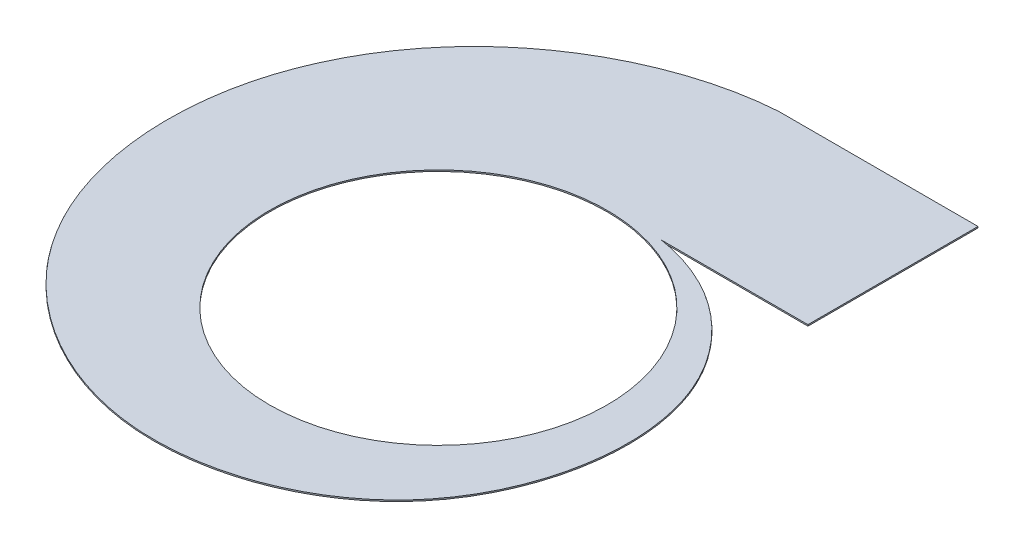
ISO-10303-21;
HEADER;
FILE_DESCRIPTION(('STEP AP214'),'2;1');
FILE_NAME('part.step','',(''),(''),'','','');
FILE_SCHEMA(('AUTOMOTIVE_DESIGN { 1 0 10303 214 1 1 1 1 }'));
ENDSEC;
DATA;
#1=APPLICATION_CONTEXT('core data for automotive mechanical design processes');
#2=APPLICATION_PROTOCOL_DEFINITION('international standard','automotive_design',2000,#1);
#3=PRODUCT_CONTEXT('',#1,'mechanical');
#4=PRODUCT('Part','Part','',(#3));
#5=PRODUCT_RELATED_PRODUCT_CATEGORY('part','',(#4));
#6=PRODUCT_DEFINITION_FORMATION('','',#4);
#7=PRODUCT_DEFINITION_CONTEXT('part definition',#1,'design');
#8=PRODUCT_DEFINITION('design','',#6,#7);
#9=PRODUCT_DEFINITION_SHAPE('','',#8);
#10=(LENGTH_UNIT() NAMED_UNIT(*) SI_UNIT(.MILLI.,.METRE.));
#11=(NAMED_UNIT(*) PLANE_ANGLE_UNIT() SI_UNIT($,.RADIAN.));
#12=(NAMED_UNIT(*) SI_UNIT($,.STERADIAN.) SOLID_ANGLE_UNIT());
#13=UNCERTAINTY_MEASURE_WITH_UNIT(LENGTH_MEASURE(1.E-05),#10,'distance_accuracy_value','');
#14=(GEOMETRIC_REPRESENTATION_CONTEXT(3) GLOBAL_UNCERTAINTY_ASSIGNED_CONTEXT((#13)) GLOBAL_UNIT_ASSIGNED_CONTEXT((#10,
#11,#12)) REPRESENTATION_CONTEXT('',''));
#15=CARTESIAN_POINT('',(0.,0.,0.));
#16=DIRECTION('',(0.,0.,1.));
#17=DIRECTION('',(1.,0.,0.));
#18=AXIS2_PLACEMENT_3D('',#15,#16,#17);
#19=CARTESIAN_POINT('',(-202.088029277198,0.,340.089037520894));
#20=DIRECTION('',(0.,-1.,0.));
#21=DIRECTION('',(0.,0.,-1.));
#22=AXIS2_PLACEMENT_3D('',#19,#20,#21);
#23=PLANE('',#22);
#24=CARTESIAN_POINT('',(0.,0.,0.));
#25=DIRECTION('',(0.,1.,0.));
#26=DIRECTION('',(0.,0.,1.));
#27=AXIS2_PLACEMENT_3D('',#24,#25,#26);
#28=CIRCLE('',#27,248.);
#29=CARTESIAN_POINT('',(0.,0.,248.));
#30=VERTEX_POINT('',#29);
#31=EDGE_CURVE('E126',#30,#30,#28,.T.);
#32=ORIENTED_EDGE('',*,*,#31,.F.);
#33=EDGE_LOOP('',(#32));
#34=FACE_BOUND('',#33,.T.);
#35=CARTESIAN_POINT('',(-1.51614831800373E-12,0.,-500.));
#36=CARTESIAN_POINT('',(-121.735694782618,0.,-491.432273979318));
#37=CARTESIAN_POINT('',(-313.70035987812,0.,-396.44166070075));
#38=CARTESIAN_POINT('',(-452.526897534728,0.,-136.273127559046));
#39=CARTESIAN_POINT('',(-438.495522047138,0.,84.5434590160957));
#40=CARTESIAN_POINT('',(-316.990167099942,0.,288.560325686227));
#41=CARTESIAN_POINT('',(-69.9789110870108,0.,425.752164190326));
#42=CARTESIAN_POINT('',(285.053092388066,0.,296.782675328895));
#43=CARTESIAN_POINT('',(348.131054402756,0.,-49.5077087625764));
#44=CARTESIAN_POINT('',(180.649502040765,0.,-235.122306433307));
#45=CARTESIAN_POINT('',(56.0182707534848,0.,-259.081421156658));
#46=CARTESIAN_POINT('',(0.,0.,-250.));
#47=B_SPLINE_CURVE_WITH_KNOTS('',3,(#35,#36,#37,#38,#39,#40,#41,#42,#43,#44,#45,#46),
.UNSPECIFIED.,.F.,.F.,(4,1,1,1,1,1,1,1,1,4),(0.,0.158819890851184,0.25244839977915,
0.369226367804826,0.42541946423916,0.556944650266808,0.698898778526058,0.846399015982612,
0.926374081741202,1.),.UNSPECIFIED.);
#48=CARTESIAN_POINT('',(-59.0712145917898,0.,376.585920873766));
#49=VERTEX_POINT('',#48);
#50=CARTESIAN_POINT('',(77.7700123232968,0.,-250.000000000145));
#51=VERTEX_POINT('',#50);
#52=EDGE_CURVE('E59',#49,#51,#47,.T.);
#53=ORIENTED_EDGE('',*,*,#52,.T.);
#54=DIRECTION('',(1.,0.,0.));
#55=VECTOR('',#54,1.);
#56=CARTESIAN_POINT('',(0.,0.,-250.));
#57=LINE('',#56,#55);
#58=CARTESIAN_POINT('',(293.259068653268,0.,-250.));
#59=VERTEX_POINT('',#58);
#60=EDGE_CURVE('E185',#51,#59,#57,.T.);
#61=ORIENTED_EDGE('',*,*,#60,.T.);
#62=DIRECTION('',(0.,0.,1.));
#63=VECTOR('',#62,1.);
#64=CARTESIAN_POINT('',(293.259068653268,0.,-500.));
#65=LINE('',#64,#63);
#66=CARTESIAN_POINT('',(293.259068653268,0.,-500.));
#67=VERTEX_POINT('',#66);
#68=EDGE_CURVE('E118',#67,#59,#65,.T.);
#69=ORIENTED_EDGE('',*,*,#68,.F.);
#70=DIRECTION('',(1.,0.,0.));
#71=VECTOR('',#70,1.);
#72=CARTESIAN_POINT('',(-1.51614831800373E-12,0.,-500.));
#73=LINE('',#72,#71);
#74=CARTESIAN_POINT('',(-1.51614831800373E-12,0.,-500.));
#75=VERTEX_POINT('',#74);
#76=EDGE_CURVE('E105',#75,#67,#73,.T.);
#77=ORIENTED_EDGE('',*,*,#76,.F.);
#78=CARTESIAN_POINT('',(-71.8416246862978,0.,375.710516909708));
#79=VERTEX_POINT('',#78);
#80=EDGE_CURVE('E13',#75,#79,#47,.T.);
#81=ORIENTED_EDGE('',*,*,#80,.T.);
#82=CARTESIAN_POINT('',(0.,0.,-250.));
#83=CARTESIAN_POINT('',(8.18123086876726,0.,-251.302083333026));
#84=CARTESIAN_POINT('',(16.4904858589972,0.,-252.202239115932));
#85=CARTESIAN_POINT('',(33.2838432146078,0.,-253.165004897292));
#86=CARTESIAN_POINT('',(41.767918014095,0.,-253.227597369565));
#87=CARTESIAN_POINT('',(58.8255292754711,0.,-252.489812838351));
#88=CARTESIAN_POINT('',(67.3990361988134,0.,-251.68942117223));
#89=CARTESIAN_POINT('',(84.5468495515692,0.,-249.209035812598));
#90=CARTESIAN_POINT('',(93.1211247685697,0.,-247.529030536377));
#91=CARTESIAN_POINT('',(110.179448675384,0.,-243.281971110244));
#92=CARTESIAN_POINT('',(118.66346480226,0.,-240.714908643898));
#93=CARTESIAN_POINT('',(135.448838643004,0.,-234.695772918887));
#94=CARTESIAN_POINT('',(143.750162787134,0.,-231.243694761559));
#95=CARTESIAN_POINT('',(160.077308395461,0.,-223.466249466396));
#96=CARTESIAN_POINT('',(168.103095643203,0.,-219.14088096369));
#97=CARTESIAN_POINT('',(183.786929166319,0.,-209.638354885954));
#98=CARTESIAN_POINT('',(191.444940950985,0.,-204.461199557863));
#99=CARTESIAN_POINT('',(206.302623466448,0.,-193.28636485957));
#100=CARTESIAN_POINT('',(213.50225981272,0.,-187.288691385962));
#101=CARTESIAN_POINT('',(227.355264370716,0.,-174.513728488617));
#102=CARTESIAN_POINT('',(234.008598689343,0.,-167.736448608729));
#103=CARTESIAN_POINT('',(246.684770923066,0.,-153.452592355728));
#104=CARTESIAN_POINT('',(252.707575824426,0.,-145.946029131675));
#105=CARTESIAN_POINT('',(264.043165004688,0.,-130.262996352308));
#106=CARTESIAN_POINT('',(269.355917530424,0.,-122.086543467484));
#107=CARTESIAN_POINT('',(279.197554898152,0.,-105.131744499288));
#108=CARTESIAN_POINT('',(283.726409621811,0.,-96.3534184851331));
#109=CARTESIAN_POINT('',(291.933011092096,0.,-78.2709576757544));
#110=CARTESIAN_POINT('',(295.610729718482,0.,-68.9668461837094));
#111=CARTESIAN_POINT('',(302.055300527236,0.,-49.9163187948688));
#112=CARTESIAN_POINT('',(304.822126933795,0.,-40.1699292330862));
#113=CARTESIAN_POINT('',(309.393446559202,0.,-20.3250245640646));
#114=CARTESIAN_POINT('',(311.19791666681,0.,-10.2265385853717));
#115=CARTESIAN_POINT('',(313.80208333319,0.,10.2265385853717));
#116=CARTESIAN_POINT('',(314.601759745985,0.,20.5810981281708));
#117=CARTESIAN_POINT('',(315.163575101264,0.,41.4453734866293));
#118=CARTESIAN_POINT('',(314.925697135991,0.,51.955055437251));
#119=CARTESIAN_POINT('',(313.389873122328,0.,73.0246821043311));
#120=CARTESIAN_POINT('',(312.091913646437,0.,83.5845910737915));
#121=CARTESIAN_POINT('',(308.424085304918,0.,104.646879333399));
#122=CARTESIAN_POINT('',(306.054206695925,0.,115.149221353839));
#123=CARTESIAN_POINT('',(300.241736514608,0.,135.986781135752));
#124=CARTESIAN_POINT('',(296.799139049597,0.,146.321960485977));
#125=CARTESIAN_POINT('',(288.851700556733,0.,166.714935062538));
#126=CARTESIAN_POINT('',(284.346857615167,0.,176.772691136304));
#127=CARTESIAN_POINT('',(274.296788150606,0.,196.501059173741));
#128=CARTESIAN_POINT('',(268.751563778678,0.,206.171631657383));
#129=CARTESIAN_POINT('',(256.653978741307,0.,225.017553672595));
#130=CARTESIAN_POINT('',(250.101624338251,0.,234.192863818506));
#131=CARTESIAN_POINT('',(236.034287727501,0.,251.943048247245));
#132=CARTESIAN_POINT('',(228.519315892065,0.,260.517883668511));
#133=CARTESIAN_POINT('',(212.58226450297,0.,276.965947185267));
#134=CARTESIAN_POINT('',(204.160199387239,0.,284.839137373345));
#135=CARTESIAN_POINT('',(186.475120704669,0.,299.787933776882));
#136=CARTESIAN_POINT('',(177.212125551479,0.,306.863503462129));
#137=CARTESIAN_POINT('',(157.921492035754,0.,320.12739541053));
#138=CARTESIAN_POINT('',(147.893875927803,0.,326.315682934834));
#139=CARTESIAN_POINT('',(127.159841084605,0.,337.722731057653));
#140=CARTESIAN_POINT('',(116.453448267127,0.,342.941459114445));
#141=CARTESIAN_POINT('',(94.4565125505682,0.,352.335503565987));
#142=CARTESIAN_POINT('',(83.1659990126438,0.,356.510790002129));
#143=CARTESIAN_POINT('',(60.1034562179506,0.,363.753400293993));
#144=CARTESIAN_POINT('',(48.3314595051577,0.,366.820697137299));
#145=CARTESIAN_POINT('',(24.4156368331883,0.,371.792967189722));
#146=CARTESIAN_POINT('',(12.271846302555,0.,373.697916666581));
#147=CARTESIAN_POINT('',(-12.2718463025549,0.,376.302083333419));
#148=CARTESIAN_POINT('',(-24.6717103972528,0.,377.001280376191));
#149=CARTESIAN_POINT('',(-49.6069037587423,0.,377.162145305084));
#150=CARTESIAN_POINT('',(-62.1421928603835,0.,376.623796902581));
#151=CARTESIAN_POINT('',(-87.2238349332148,0.,374.289933406142));
#152=CARTESIAN_POINT('',(-99.7701459485291,0.,372.49440611977));
#153=CARTESIAN_POINT('',(-124.746909115469,0.,367.63913479811));
#154=CARTESIAN_POINT('',(-137.177317939081,0.,364.579382854976));
#155=CARTESIAN_POINT('',(-161.794113596146,0.,357.201501919467));
#156=CARTESIAN_POINT('',(-173.980456169745,0.,352.883369455503));
#157=CARTESIAN_POINT('',(-197.981031482019,0.,343.007628194371));
#158=CARTESIAN_POINT('',(-209.795219485259,0.,337.450020469828));
#159=CARTESIAN_POINT('',(-232.924809952237,0.,325.127326833763));
#160=CARTESIAN_POINT('',(-244.240167672522,0.,318.362246594301));
#161=CARTESIAN_POINT('',(-266.248178177912,0.,303.669602596026));
#162=CARTESIAN_POINT('',(-276.940786686513,0.,295.742049119143));
#163=CARTESIAN_POINT('',(-297.583473027557,0.,278.782210594927));
#164=CARTESIAN_POINT('',(-307.533507523385,0.,269.749940397866));
#165=CARTESIAN_POINT('',(-326.576630000735,0.,250.650800517624));
#166=CARTESIAN_POINT('',(-335.66967605612,0.,240.583950165703));
#167=CARTESIAN_POINT('',(-352.891096631925,0.,219.497649053655));
#168=CARTESIAN_POINT('',(-361.019431100395,0.,208.478221971));
#169=CARTESIAN_POINT('',(-376.211625815808,0.,185.579987719483));
#170=CARTESIAN_POINT('',(-383.27544833862,0.,173.701208388017));
#171=CARTESIAN_POINT('',(-396.247907217778,0.,149.187937670028));
#172=CARTESIAN_POINT('',(-402.156508607812,0.,136.553478048962));
#173=CARTESIAN_POINT('',(-412.737996039147,0.,110.642067425541));
#174=CARTESIAN_POINT('',(-417.410850285412,0.,97.3651518416145));
#175=CARTESIAN_POINT('',(-425.451500061114,0.,70.2905936409961));
#176=CARTESIAN_POINT('',(-428.819267340828,0.,56.4929897772418));
#177=CARTESIAN_POINT('',(-434.192487820218,0.,28.506249102299));
#178=CARTESIAN_POINT('',(-436.197916666667,0.,14.3171540197475));
#179=CARTESIAN_POINT('',(-438.802083333333,0.,-14.3171540197474));
#180=CARTESIAN_POINT('',(-439.400801007106,0.,-28.7623226663634));
#181=CARTESIAN_POINT('',(-439.160715508193,0.,-57.7684340308264));
#182=CARTESIAN_POINT('',(-438.321896668493,0.,-72.3293302831626));
#183=CARTESIAN_POINT('',(-435.189993690634,0.,-101.422987762452));
#184=CARTESIAN_POINT('',(-432.896898593371,0.,-115.955700823236));
#185=CARTESIAN_POINT('',(-426.854184291036,0.,-144.84693889757));
#186=CARTESIAN_POINT('',(-423.104559014809,0.,-159.205414523896));
#187=CARTESIAN_POINT('',(-414.161267323544,0.,-187.601446056967));
#188=CARTESIAN_POINT('',(-408.967599860772,0.,-201.6389518534));
#189=CARTESIAN_POINT('',(-397.163555832647,0.,-229.247127901613));
#190=CARTESIAN_POINT('',(-390.553183323022,0.,-242.817747834191));
#191=CARTESIAN_POINT('',(-375.957865518387,0.,-269.348560730755));
#192=CARTESIAN_POINT('',(-367.972929409144,0.,-282.308703685947));
#193=CARTESIAN_POINT('',(-350.685226451526,0.,-307.478802684943));
#194=CARTESIAN_POINT('',(-341.382473899903,0.,-319.688709554456));
#195=CARTESIAN_POINT('',(-321.530133462485,0.,-343.223897807932));
#196=CARTESIAN_POINT('',(-310.980564904314,0.,-354.549131377893));
#197=CARTESIAN_POINT('',(-288.719336531633,0.,-376.187312816569));
#198=CARTESIAN_POINT('',(-277.007700944567,0.,-386.500214741127));
#199=CARTESIAN_POINT('',(-252.520177402242,0.,-405.994259484737));
#200=CARTESIAN_POINT('',(-239.744318390542,0.,-415.175358738827));
#201=CARTESIAN_POINT('',(-213.238483403191,0.,-432.295856220921));
#202=CARTESIAN_POINT('',(-199.508540848464,0.,-440.235213743901));
#203=CARTESIAN_POINT('',(-171.216034255217,0.,-454.773083376408));
#204=CARTESIAN_POINT('',(-156.653507830614,0.,-461.37155810041));
#205=CARTESIAN_POINT('',(-126.827622300697,0.,-473.140488513076));
#206=CARTESIAN_POINT('',(-111.564304670424,0.,-478.310910570318));
#207=CARTESIAN_POINT('',(-80.4777310642031,0.,-487.149599826612));
#208=CARTESIAN_POINT('',(-64.6545200493005,0.,-490.817837543946));
#209=CARTESIAN_POINT('',(-32.5968613714353,0.,-496.592008451125));
#210=CARTESIAN_POINT('',(-16.3624617374858,0.,-498.697916666211));
#211=CARTESIAN_POINT('',(-1.51614831800373E-12,0.,-500.));
#212=B_SPLINE_CURVE_WITH_KNOTS('',3,(#82,#83,#84,#85,#86,#87,#88,#89,#90,#91,#92,#93,#94,#95,
#96,#97,#98,#99,#100,#101,#102,#103,#104,#105,#106,#107,#108,#109,#110,#111,#112,#113,#114,#115,
#116,#117,#118,#119,#120,#121,#122,#123,#124,#125,#126,#127,#128,#129,#130,#131,#132,#133,#134,
#135,#136,#137,#138,#139,#140,#141,#142,#143,#144,#145,#146,#147,#148,#149,#150,#151,#152,#153,
#154,#155,#156,#157,#158,#159,#160,#161,#162,#163,#164,#165,#166,#167,#168,#169,#170,#171,#172,
#173,#174,#175,#176,#177,#178,#179,#180,#181,#182,#183,#184,#185,#186,#187,#188,#189,#190,#191,
#192,#193,#194,#195,#196,#197,#198,#199,#200,#201,#202,#203,#204,#205,#206,#207,#208,#209,#210,
#211),.UNSPECIFIED.,.F.,.F.,(4,2,2,2,2,2,2,2,2,2,2,2,2,2,2,2,2,2,2,2,2,2,2,2,2,2,2,2,2,2,2,2,2,
2,2,2,2,2,2,2,2,2,2,2,2,2,2,2,2,2,2,2,2,2,2,2,2,2,2,2,2,2,2,2,4),(0.,0.015625,0.03125,0.046875,
0.0625,0.078125,0.09375,0.109375,0.125,0.140625,0.15625,0.171875,0.1875,0.203125,0.21875,
0.234375,0.25,0.265625,0.28125,0.296875,0.3125,0.328125,0.34375,0.359375,0.375,0.390625,0.40625,
0.421875,0.4375,0.453125,0.46875,0.484375,0.5,0.515625,0.53125,0.546875,0.5625,0.578125,0.59375,
0.609375,0.625,0.640625,0.65625,0.671875,0.6875,0.703125,0.71875,0.734375,0.75,0.765625,0.78125,
0.796875,0.8125,0.828125,0.84375,0.859375,0.875,0.890625,0.90625,0.921875,0.9375,0.953125,
0.96875,0.984375,1.),.UNSPECIFIED.);
#213=EDGE_CURVE('E152',#49,#79,#212,.T.);
#214=ORIENTED_EDGE('',*,*,#213,.F.);
#215=EDGE_LOOP('',(#53,#61,#69,#77,#81,#214));
#216=FACE_BOUND('',#215,.T.);
#217=ADVANCED_FACE('F48',(#34,#216),#23,.F.);
#218=CARTESIAN_POINT('',(-1.51614831800373E-12,-2.,-500.));
#219=CARTESIAN_POINT('',(-121.735694782618,-2.,-491.432273979318));
#220=CARTESIAN_POINT('',(-313.70035987812,-2.,-396.44166070075));
#221=CARTESIAN_POINT('',(-452.526897534728,-2.,-136.273127559046));
#222=CARTESIAN_POINT('',(-438.495522047138,-2.,84.5434590160957));
#223=CARTESIAN_POINT('',(-316.990167099942,-2.,288.560325686227));
#224=CARTESIAN_POINT('',(-69.9789110870108,-2.,425.752164190326));
#225=CARTESIAN_POINT('',(285.053092388066,-2.,296.782675328895));
#226=CARTESIAN_POINT('',(348.131054402756,-2.,-49.5077087625764));
#227=CARTESIAN_POINT('',(180.649502040765,-2.,-235.122306433307));
#228=CARTESIAN_POINT('',(56.0182707534848,-2.,-259.081421156658));
#229=CARTESIAN_POINT('',(0.,-2.,-250.));
#230=B_SPLINE_CURVE_WITH_KNOTS('',3,(#218,#219,#220,#221,#222,#223,#224,#225,#226,#227,#228,
#229),.UNSPECIFIED.,.F.,.F.,(4,1,1,1,1,1,1,1,1,4),(0.,0.158819890851184,0.25244839977915,
0.369226367804826,0.42541946423916,0.556944650266808,0.698898778526058,0.846399015982612,
0.926374081741202,1.),.UNSPECIFIED.);
#231=DIRECTION('',(0.,1.,0.));
#232=VECTOR('',#231,1.);
#233=SURFACE_OF_LINEAR_EXTRUSION('',#230,#232);
#234=DIRECTION('',(0.,1.,0.));
#235=VECTOR('',#234,1.);
#236=CARTESIAN_POINT('',(77.7700123242326,-2.,-250.));
#237=LINE('',#236,#235);
#238=CARTESIAN_POINT('',(77.7700123232971,-2.,-250.000000000145));
#239=VERTEX_POINT('',#238);
#240=EDGE_CURVE('E67',#51,#239,#237,.F.);
#241=ORIENTED_EDGE('',*,*,#240,.F.);
#242=ORIENTED_EDGE('',*,*,#52,.F.);
#243=ORIENTED_EDGE('',*,*,#213,.T.);
#244=ORIENTED_EDGE('',*,*,#80,.F.);
#245=DIRECTION('',(0.,1.,0.));
#246=VECTOR('',#245,1.);
#247=CARTESIAN_POINT('',(-1.51614831800373E-12,-2.,-500.));
#248=LINE('',#247,#246);
#249=CARTESIAN_POINT('',(-1.51614831800373E-12,-2.,-500.));
#250=VERTEX_POINT('',#249);
#251=EDGE_CURVE('E132',#250,#75,#248,.T.);
#252=ORIENTED_EDGE('',*,*,#251,.F.);
#253=EDGE_CURVE('E72',#250,#239,#230,.T.);
#254=ORIENTED_EDGE('',*,*,#253,.T.);
#255=EDGE_LOOP('',(#241,#242,#243,#244,#252,#254));
#256=FACE_BOUND('',#255,.T.);
#257=ADVANCED_FACE('F50',(#256),#233,.T.);
#258=CARTESIAN_POINT('',(-202.088029277198,-2.,340.089037520894));
#259=DIRECTION('',(0.,-1.,0.));
#260=DIRECTION('',(0.,0.,-1.));
#261=AXIS2_PLACEMENT_3D('',#258,#259,#260);
#262=PLANE('',#261);
#263=ORIENTED_EDGE('',*,*,#253,.F.);
#264=DIRECTION('',(1.,0.,0.));
#265=VECTOR('',#264,1.);
#266=CARTESIAN_POINT('',(-1.51614831800373E-12,-2.,-500.));
#267=LINE('',#266,#265);
#268=CARTESIAN_POINT('',(293.259068653268,-2.,-500.));
#269=VERTEX_POINT('',#268);
#270=EDGE_CURVE('E111',#250,#269,#267,.T.);
#271=ORIENTED_EDGE('',*,*,#270,.T.);
#272=DIRECTION('',(0.,0.,1.));
#273=VECTOR('',#272,1.);
#274=CARTESIAN_POINT('',(293.259068653268,-2.,-500.));
#275=LINE('',#274,#273);
#276=CARTESIAN_POINT('',(293.259068653268,-2.,-250.));
#277=VERTEX_POINT('',#276);
#278=EDGE_CURVE('E104',#269,#277,#275,.T.);
#279=ORIENTED_EDGE('',*,*,#278,.T.);
#280=DIRECTION('',(1.,0.,0.));
#281=VECTOR('',#280,1.);
#282=CARTESIAN_POINT('',(0.,-2.,-250.));
#283=LINE('',#282,#281);
#284=EDGE_CURVE('E96',#239,#277,#283,.T.);
#285=ORIENTED_EDGE('',*,*,#284,.F.);
#286=EDGE_LOOP('',(#263,#271,#279,#285));
#287=FACE_BOUND('',#286,.T.);
#288=CARTESIAN_POINT('',(0.,-2.,0.));
#289=DIRECTION('',(0.,-1.,0.));
#290=DIRECTION('',(0.,0.,-1.));
#291=AXIS2_PLACEMENT_3D('',#288,#289,#290);
#292=CIRCLE('',#291,248.);
#293=CARTESIAN_POINT('',(0.,-2.,-248.));
#294=VERTEX_POINT('',#293);
#295=EDGE_CURVE('E54',#294,#294,#292,.T.);
#296=ORIENTED_EDGE('',*,*,#295,.F.);
#297=EDGE_LOOP('',(#296));
#298=FACE_BOUND('',#297,.T.);
#299=ADVANCED_FACE('F108',(#287,#298),#262,.T.);
#300=CARTESIAN_POINT('',(0.,-10.,0.));
#301=DIRECTION('',(0.,1.,0.));
#302=DIRECTION('',(0.,0.,1.));
#303=AXIS2_PLACEMENT_3D('',#300,#301,#302);
#304=CYLINDRICAL_SURFACE('',#303,248.);
#305=ORIENTED_EDGE('',*,*,#295,.T.);
#306=EDGE_LOOP('',(#305));
#307=FACE_BOUND('',#306,.T.);
#308=ORIENTED_EDGE('',*,*,#31,.T.);
#309=EDGE_LOOP('',(#308));
#310=FACE_BOUND('',#309,.T.);
#311=ADVANCED_FACE('F170',(#307,#310),#304,.F.);
#312=CARTESIAN_POINT('',(-1.51614831800373E-12,-2.,-500.));
#313=DIRECTION('',(0.,0.,1.));
#314=DIRECTION('',(1.,0.,0.));
#315=AXIS2_PLACEMENT_3D('',#312,#313,#314);
#316=PLANE('',#315);
#317=ORIENTED_EDGE('',*,*,#76,.T.);
#318=DIRECTION('',(0.,1.,0.));
#319=VECTOR('',#318,1.);
#320=CARTESIAN_POINT('',(293.259068653268,-2.,-500.));
#321=LINE('',#320,#319);
#322=EDGE_CURVE('E119',#269,#67,#321,.T.);
#323=ORIENTED_EDGE('',*,*,#322,.F.);
#324=ORIENTED_EDGE('',*,*,#270,.F.);
#325=ORIENTED_EDGE('',*,*,#251,.T.);
#326=EDGE_LOOP('',(#317,#323,#324,#325));
#327=FACE_BOUND('',#326,.T.);
#328=ADVANCED_FACE('F173',(#327),#316,.F.);
#329=CARTESIAN_POINT('',(293.259068653268,-2.,-500.));
#330=DIRECTION('',(-1.,0.,0.));
#331=DIRECTION('',(0.,0.,1.));
#332=AXIS2_PLACEMENT_3D('',#329,#330,#331);
#333=PLANE('',#332);
#334=ORIENTED_EDGE('',*,*,#68,.T.);
#335=DIRECTION('',(0.,1.,0.));
#336=VECTOR('',#335,1.);
#337=CARTESIAN_POINT('',(293.259068653268,-2.,-250.));
#338=LINE('',#337,#336);
#339=EDGE_CURVE('E101',#277,#59,#338,.T.);
#340=ORIENTED_EDGE('',*,*,#339,.F.);
#341=ORIENTED_EDGE('',*,*,#278,.F.);
#342=ORIENTED_EDGE('',*,*,#322,.T.);
#343=EDGE_LOOP('',(#334,#340,#341,#342));
#344=FACE_BOUND('',#343,.T.);
#345=ADVANCED_FACE('F116',(#344),#333,.F.);
#346=CARTESIAN_POINT('',(0.,-2.,-250.));
#347=DIRECTION('',(0.,0.,1.));
#348=DIRECTION('',(1.,0.,0.));
#349=AXIS2_PLACEMENT_3D('',#346,#347,#348);
#350=PLANE('',#349);
#351=ORIENTED_EDGE('',*,*,#60,.F.);
#352=ORIENTED_EDGE('',*,*,#240,.T.);
#353=ORIENTED_EDGE('',*,*,#284,.T.);
#354=ORIENTED_EDGE('',*,*,#339,.T.);
#355=EDGE_LOOP('',(#351,#352,#353,#354));
#356=FACE_BOUND('',#355,.T.);
#357=ADVANCED_FACE('F99',(#356),#350,.T.);
#358=CLOSED_SHELL('',(#217,#257,#299,#311,#328,#345,#357));
#359=MANIFOLD_SOLID_BREP('B2',#358);
#360=ADVANCED_BREP_SHAPE_REPRESENTATION('',(#18,#359),#14);
#361=SHAPE_DEFINITION_REPRESENTATION(#9,#360);
ENDSEC;
END-ISO-10303-21;
